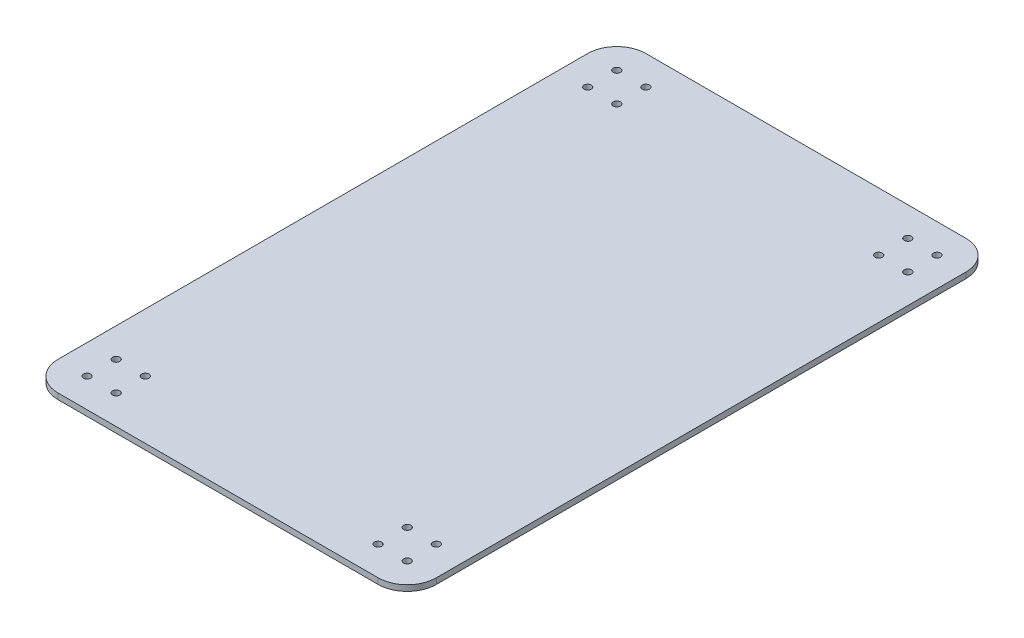
ISO-10303-21;
HEADER;
FILE_DESCRIPTION(('STEP AP214'),'2;1');
FILE_NAME('part.step','',(''),(''),'','','');
FILE_SCHEMA(('AUTOMOTIVE_DESIGN { 1 0 10303 214 1 1 1 1 }'));
ENDSEC;
DATA;
#1=APPLICATION_CONTEXT('core data for automotive mechanical design processes');
#2=APPLICATION_PROTOCOL_DEFINITION('international standard','automotive_design',2000,#1);
#3=PRODUCT_CONTEXT('',#1,'mechanical');
#4=PRODUCT('Part','Part','',(#3));
#5=PRODUCT_RELATED_PRODUCT_CATEGORY('part','',(#4));
#6=PRODUCT_DEFINITION_FORMATION('','',#4);
#7=PRODUCT_DEFINITION_CONTEXT('part definition',#1,'design');
#8=PRODUCT_DEFINITION('design','',#6,#7);
#9=PRODUCT_DEFINITION_SHAPE('','',#8);
#10=(LENGTH_UNIT() NAMED_UNIT(*) SI_UNIT(.MILLI.,.METRE.));
#11=(NAMED_UNIT(*) PLANE_ANGLE_UNIT() SI_UNIT($,.RADIAN.));
#12=(NAMED_UNIT(*) SI_UNIT($,.STERADIAN.) SOLID_ANGLE_UNIT());
#13=UNCERTAINTY_MEASURE_WITH_UNIT(LENGTH_MEASURE(1.E-05),#10,'distance_accuracy_value','');
#14=(GEOMETRIC_REPRESENTATION_CONTEXT(3) GLOBAL_UNCERTAINTY_ASSIGNED_CONTEXT((#13)) GLOBAL_UNIT_ASSIGNED_CONTEXT((#10,
#11,#12)) REPRESENTATION_CONTEXT('',''));
#15=CARTESIAN_POINT('',(0.,0.,0.));
#16=DIRECTION('',(0.,0.,1.));
#17=DIRECTION('',(1.,0.,0.));
#18=AXIS2_PLACEMENT_3D('',#15,#16,#17);
#19=CARTESIAN_POINT('',(-147.260105463568,5.08,256.34291835553));
#20=DIRECTION('',(0.,1.,0.));
#21=DIRECTION('',(0.,0.,1.));
#22=AXIS2_PLACEMENT_3D('',#19,#20,#21);
#23=PLANE('',#22);
#24=CARTESIAN_POINT('',(-121.860105463563,5.08,256.34291835553));
#25=DIRECTION('',(0.,1.,0.));
#26=DIRECTION('',(0.,0.,1.));
#27=AXIS2_PLACEMENT_3D('',#24,#25,#26);
#28=CIRCLE('',#27,3.175);
#29=CARTESIAN_POINT('',(-121.860105463563,5.08,259.51791835553));
#30=VERTEX_POINT('',#29);
#31=EDGE_CURVE('E266',#30,#30,#28,.T.);
#32=ORIENTED_EDGE('',*,*,#31,.F.);
#33=EDGE_LOOP('',(#32));
#34=FACE_BOUND('',#33,.T.);
#35=CARTESIAN_POINT('',(-147.260105463563,5.08,230.94291835553));
#36=DIRECTION('',(0.,1.,0.));
#37=DIRECTION('',(0.,0.,1.));
#38=AXIS2_PLACEMENT_3D('',#35,#36,#37);
#39=CIRCLE('',#38,3.175);
#40=CARTESIAN_POINT('',(-147.260105463563,5.08,234.11791835553));
#41=VERTEX_POINT('',#40);
#42=EDGE_CURVE('E254',#41,#41,#39,.T.);
#43=ORIENTED_EDGE('',*,*,#42,.F.);
#44=EDGE_LOOP('',(#43));
#45=FACE_BOUND('',#44,.T.);
#46=CARTESIAN_POINT('',(132.139894536437,5.08,256.34291835553));
#47=DIRECTION('',(0.,1.,0.));
#48=DIRECTION('',(0.,0.,1.));
#49=AXIS2_PLACEMENT_3D('',#46,#47,#48);
#50=CIRCLE('',#49,3.175);
#51=CARTESIAN_POINT('',(132.139894536437,5.08,259.51791835553));
#52=VERTEX_POINT('',#51);
#53=EDGE_CURVE('E242',#52,#52,#50,.T.);
#54=ORIENTED_EDGE('',*,*,#53,.F.);
#55=EDGE_LOOP('',(#54));
#56=FACE_BOUND('',#55,.T.);
#57=CARTESIAN_POINT('',(106.739894536437,5.08,230.94291835553));
#58=DIRECTION('',(0.,1.,0.));
#59=DIRECTION('',(0.,0.,1.));
#60=AXIS2_PLACEMENT_3D('',#57,#58,#59);
#61=CIRCLE('',#60,3.175);
#62=CARTESIAN_POINT('',(106.739894536437,5.08,234.11791835553));
#63=VERTEX_POINT('',#62);
#64=EDGE_CURVE('E230',#63,#63,#61,.T.);
#65=ORIENTED_EDGE('',*,*,#64,.F.);
#66=EDGE_LOOP('',(#65));
#67=FACE_BOUND('',#66,.T.);
#68=CARTESIAN_POINT('',(132.139894536433,5.08,-180.53708164447));
#69=DIRECTION('',(0.,1.,0.));
#70=DIRECTION('',(0.,0.,1.));
#71=AXIS2_PLACEMENT_3D('',#68,#69,#70);
#72=CIRCLE('',#71,3.175);
#73=CARTESIAN_POINT('',(132.139894536433,5.08,-177.36208164447));
#74=VERTEX_POINT('',#73);
#75=EDGE_CURVE('E218',#74,#74,#72,.T.);
#76=ORIENTED_EDGE('',*,*,#75,.F.);
#77=EDGE_LOOP('',(#76));
#78=FACE_BOUND('',#77,.T.);
#79=CARTESIAN_POINT('',(106.739894536432,5.08,-205.93708164447));
#80=DIRECTION('',(0.,1.,0.));
#81=DIRECTION('',(0.,0.,1.));
#82=AXIS2_PLACEMENT_3D('',#79,#80,#81);
#83=CIRCLE('',#82,3.175);
#84=CARTESIAN_POINT('',(106.739894536432,5.08,-202.76208164447));
#85=VERTEX_POINT('',#84);
#86=EDGE_CURVE('E206',#85,#85,#83,.T.);
#87=ORIENTED_EDGE('',*,*,#86,.F.);
#88=EDGE_LOOP('',(#87));
#89=FACE_BOUND('',#88,.T.);
#90=CARTESIAN_POINT('',(-121.860105463567,5.08,-180.53708164447));
#91=DIRECTION('',(0.,1.,0.));
#92=DIRECTION('',(0.,0.,1.));
#93=AXIS2_PLACEMENT_3D('',#90,#91,#92);
#94=CIRCLE('',#93,3.175);
#95=CARTESIAN_POINT('',(-121.860105463567,5.08,-177.36208164447));
#96=VERTEX_POINT('',#95);
#97=EDGE_CURVE('E194',#96,#96,#94,.T.);
#98=ORIENTED_EDGE('',*,*,#97,.F.);
#99=EDGE_LOOP('',(#98));
#100=FACE_BOUND('',#99,.T.);
#101=CARTESIAN_POINT('',(-147.260105463568,5.08,-205.93708164447));
#102=DIRECTION('',(0.,1.,0.));
#103=DIRECTION('',(0.,0.,1.));
#104=AXIS2_PLACEMENT_3D('',#101,#102,#103);
#105=CIRCLE('',#104,3.175);
#106=CARTESIAN_POINT('',(-147.260105463568,5.08,-202.76208164447));
#107=VERTEX_POINT('',#106);
#108=EDGE_CURVE('E140',#107,#107,#105,.T.);
#109=ORIENTED_EDGE('',*,*,#108,.F.);
#110=EDGE_LOOP('',(#109));
#111=FACE_BOUND('',#110,.T.);
#112=CARTESIAN_POINT('',(-147.260105463568,5.08,256.34291835553));
#113=DIRECTION('',(0.,1.,0.));
#114=DIRECTION('',(0.,0.,1.));
#115=AXIS2_PLACEMENT_3D('',#112,#113,#114);
#116=CIRCLE('',#115,25.4);
#117=CARTESIAN_POINT('',(-172.660105463568,5.08,256.34291835553));
#118=VERTEX_POINT('',#117);
#119=CARTESIAN_POINT('',(-147.260105463567,5.08,281.74291835553));
#120=VERTEX_POINT('',#119);
#121=EDGE_CURVE('E151',#118,#120,#116,.T.);
#122=ORIENTED_EDGE('',*,*,#121,.T.);
#123=DIRECTION('',(1.,0.,0.));
#124=VECTOR('',#123,1.);
#125=CARTESIAN_POINT('',(-147.260105463567,5.08,281.74291835553));
#126=LINE('',#125,#124);
#127=CARTESIAN_POINT('',(132.139894536432,5.08,281.74291835553));
#128=VERTEX_POINT('',#127);
#129=EDGE_CURVE('E99',#120,#128,#126,.T.);
#130=ORIENTED_EDGE('',*,*,#129,.T.);
#131=CARTESIAN_POINT('',(132.139894536432,5.08,256.34291835553));
#132=DIRECTION('',(0.,1.,0.));
#133=DIRECTION('',(0.,0.,1.));
#134=AXIS2_PLACEMENT_3D('',#131,#132,#133);
#135=CIRCLE('',#134,25.4);
#136=CARTESIAN_POINT('',(157.539894536432,5.08,256.34291835553));
#137=VERTEX_POINT('',#136);
#138=EDGE_CURVE('E166',#128,#137,#135,.T.);
#139=ORIENTED_EDGE('',*,*,#138,.T.);
#140=DIRECTION('',(0.,0.,-1.));
#141=VECTOR('',#140,1.);
#142=CARTESIAN_POINT('',(157.539894536432,5.08,-205.93708164447));
#143=LINE('',#142,#141);
#144=CARTESIAN_POINT('',(157.539894536432,5.08,-205.93708164447));
#145=VERTEX_POINT('',#144);
#146=EDGE_CURVE('E179',#137,#145,#143,.T.);
#147=ORIENTED_EDGE('',*,*,#146,.T.);
#148=CARTESIAN_POINT('',(132.139894536432,5.08,-205.93708164447));
#149=DIRECTION('',(0.,1.,0.));
#150=DIRECTION('',(0.,0.,-1.));
#151=AXIS2_PLACEMENT_3D('',#148,#149,#150);
#152=CIRCLE('',#151,25.4);
#153=CARTESIAN_POINT('',(132.139894536432,5.08,-231.33708164447));
#154=VERTEX_POINT('',#153);
#155=EDGE_CURVE('E118',#145,#154,#152,.T.);
#156=ORIENTED_EDGE('',*,*,#155,.T.);
#157=DIRECTION('',(-1.,0.,0.));
#158=VECTOR('',#157,1.);
#159=CARTESIAN_POINT('',(-147.260105463567,5.08,-231.33708164447));
#160=LINE('',#159,#158);
#161=CARTESIAN_POINT('',(-147.260105463567,5.08,-231.33708164447));
#162=VERTEX_POINT('',#161);
#163=EDGE_CURVE('E112',#154,#162,#160,.T.);
#164=ORIENTED_EDGE('',*,*,#163,.T.);
#165=CARTESIAN_POINT('',(-147.260105463568,5.08,-205.93708164447));
#166=DIRECTION('',(0.,1.,0.));
#167=DIRECTION('',(0.,0.,1.));
#168=AXIS2_PLACEMENT_3D('',#165,#166,#167);
#169=CIRCLE('',#168,25.4);
#170=CARTESIAN_POINT('',(-172.660105463568,5.08,-205.93708164447));
#171=VERTEX_POINT('',#170);
#172=EDGE_CURVE('E116',#162,#171,#169,.T.);
#173=ORIENTED_EDGE('',*,*,#172,.T.);
#174=DIRECTION('',(0.,0.,1.));
#175=VECTOR('',#174,1.);
#176=CARTESIAN_POINT('',(-172.660105463568,5.08,-205.93708164447));
#177=LINE('',#176,#175);
#178=EDGE_CURVE('E56',#171,#118,#177,.T.);
#179=ORIENTED_EDGE('',*,*,#178,.T.);
#180=EDGE_LOOP('',(#122,#130,#139,#147,#156,#164,#173,#179));
#181=FACE_BOUND('',#180,.T.);
#182=CARTESIAN_POINT('',(-121.860105463568,5.08,-205.93708164447));
#183=DIRECTION('',(0.,1.,0.));
#184=DIRECTION('',(0.,0.,1.));
#185=AXIS2_PLACEMENT_3D('',#182,#183,#184);
#186=CIRCLE('',#185,3.175);
#187=CARTESIAN_POINT('',(-121.860105463568,5.08,-202.76208164447));
#188=VERTEX_POINT('',#187);
#189=EDGE_CURVE('E188',#188,#188,#186,.T.);
#190=ORIENTED_EDGE('',*,*,#189,.F.);
#191=EDGE_LOOP('',(#190));
#192=FACE_BOUND('',#191,.T.);
#193=CARTESIAN_POINT('',(-147.260105463567,5.08,-180.53708164447));
#194=DIRECTION('',(0.,1.,0.));
#195=DIRECTION('',(0.,0.,1.));
#196=AXIS2_PLACEMENT_3D('',#193,#194,#195);
#197=CIRCLE('',#196,3.175);
#198=CARTESIAN_POINT('',(-147.260105463567,5.08,-177.36208164447));
#199=VERTEX_POINT('',#198);
#200=EDGE_CURVE('E200',#199,#199,#197,.T.);
#201=ORIENTED_EDGE('',*,*,#200,.F.);
#202=EDGE_LOOP('',(#201));
#203=FACE_BOUND('',#202,.T.);
#204=CARTESIAN_POINT('',(132.139894536432,5.08,-205.93708164447));
#205=DIRECTION('',(0.,1.,0.));
#206=DIRECTION('',(0.,0.,1.));
#207=AXIS2_PLACEMENT_3D('',#204,#205,#206);
#208=CIRCLE('',#207,3.175);
#209=CARTESIAN_POINT('',(132.139894536432,5.08,-202.76208164447));
#210=VERTEX_POINT('',#209);
#211=EDGE_CURVE('E212',#210,#210,#208,.T.);
#212=ORIENTED_EDGE('',*,*,#211,.F.);
#213=EDGE_LOOP('',(#212));
#214=FACE_BOUND('',#213,.T.);
#215=CARTESIAN_POINT('',(106.739894536433,5.08,-180.53708164447));
#216=DIRECTION('',(0.,1.,0.));
#217=DIRECTION('',(0.,0.,1.));
#218=AXIS2_PLACEMENT_3D('',#215,#216,#217);
#219=CIRCLE('',#218,3.175);
#220=CARTESIAN_POINT('',(106.739894536433,5.08,-177.36208164447));
#221=VERTEX_POINT('',#220);
#222=EDGE_CURVE('E224',#221,#221,#219,.T.);
#223=ORIENTED_EDGE('',*,*,#222,.F.);
#224=EDGE_LOOP('',(#223));
#225=FACE_BOUND('',#224,.T.);
#226=CARTESIAN_POINT('',(132.139894536437,5.08,230.94291835553));
#227=DIRECTION('',(0.,1.,0.));
#228=DIRECTION('',(0.,0.,1.));
#229=AXIS2_PLACEMENT_3D('',#226,#227,#228);
#230=CIRCLE('',#229,3.175);
#231=CARTESIAN_POINT('',(132.139894536437,5.08,234.11791835553));
#232=VERTEX_POINT('',#231);
#233=EDGE_CURVE('E236',#232,#232,#230,.T.);
#234=ORIENTED_EDGE('',*,*,#233,.F.);
#235=EDGE_LOOP('',(#234));
#236=FACE_BOUND('',#235,.T.);
#237=CARTESIAN_POINT('',(106.739894536437,5.08,256.34291835553));
#238=DIRECTION('',(0.,1.,0.));
#239=DIRECTION('',(0.,0.,1.));
#240=AXIS2_PLACEMENT_3D('',#237,#238,#239);
#241=CIRCLE('',#240,3.175);
#242=CARTESIAN_POINT('',(106.739894536437,5.08,259.51791835553));
#243=VERTEX_POINT('',#242);
#244=EDGE_CURVE('E248',#243,#243,#241,.T.);
#245=ORIENTED_EDGE('',*,*,#244,.F.);
#246=EDGE_LOOP('',(#245));
#247=FACE_BOUND('',#246,.T.);
#248=CARTESIAN_POINT('',(-121.860105463563,5.08,230.94291835553));
#249=DIRECTION('',(0.,1.,0.));
#250=DIRECTION('',(0.,0.,1.));
#251=AXIS2_PLACEMENT_3D('',#248,#249,#250);
#252=CIRCLE('',#251,3.175);
#253=CARTESIAN_POINT('',(-121.860105463563,5.08,234.11791835553));
#254=VERTEX_POINT('',#253);
#255=EDGE_CURVE('E260',#254,#254,#252,.T.);
#256=ORIENTED_EDGE('',*,*,#255,.F.);
#257=EDGE_LOOP('',(#256));
#258=FACE_BOUND('',#257,.T.);
#259=CARTESIAN_POINT('',(-147.260105463563,5.08,256.34291835553));
#260=DIRECTION('',(0.,1.,0.));
#261=DIRECTION('',(0.,0.,1.));
#262=AXIS2_PLACEMENT_3D('',#259,#260,#261);
#263=CIRCLE('',#262,3.175);
#264=CARTESIAN_POINT('',(-147.260105463563,5.08,259.51791835553));
#265=VERTEX_POINT('',#264);
#266=EDGE_CURVE('E272',#265,#265,#263,.T.);
#267=ORIENTED_EDGE('',*,*,#266,.F.);
#268=EDGE_LOOP('',(#267));
#269=FACE_BOUND('',#268,.T.);
#270=ADVANCED_FACE('F39',(#34,#45,#56,#67,#78,#89,#100,#111,#181,#192,#203,#214,#225,#236,#247,
#258,#269),#23,.T.);
#271=CARTESIAN_POINT('',(-147.260105463568,0.,256.34291835553));
#272=DIRECTION('',(0.,1.,0.));
#273=DIRECTION('',(0.,0.,1.));
#274=AXIS2_PLACEMENT_3D('',#271,#272,#273);
#275=PLANE('',#274);
#276=CARTESIAN_POINT('',(-147.260105463568,0.,256.34291835553));
#277=DIRECTION('',(0.,1.,0.));
#278=DIRECTION('',(0.,0.,1.));
#279=AXIS2_PLACEMENT_3D('',#276,#277,#278);
#280=CIRCLE('',#279,25.4);
#281=CARTESIAN_POINT('',(-172.660105463568,0.,256.34291835553));
#282=VERTEX_POINT('',#281);
#283=CARTESIAN_POINT('',(-147.260105463567,0.,281.74291835553));
#284=VERTEX_POINT('',#283);
#285=EDGE_CURVE('E136',#282,#284,#280,.T.);
#286=ORIENTED_EDGE('',*,*,#285,.F.);
#287=DIRECTION('',(0.,0.,1.));
#288=VECTOR('',#287,1.);
#289=CARTESIAN_POINT('',(-172.660105463568,0.,-205.93708164447));
#290=LINE('',#289,#288);
#291=CARTESIAN_POINT('',(-172.660105463568,0.,-205.93708164447));
#292=VERTEX_POINT('',#291);
#293=EDGE_CURVE('E91',#292,#282,#290,.T.);
#294=ORIENTED_EDGE('',*,*,#293,.F.);
#295=CARTESIAN_POINT('',(-147.260105463568,0.,-205.93708164447));
#296=DIRECTION('',(0.,1.,0.));
#297=DIRECTION('',(0.,0.,1.));
#298=AXIS2_PLACEMENT_3D('',#295,#296,#297);
#299=CIRCLE('',#298,25.4);
#300=CARTESIAN_POINT('',(-147.260105463567,0.,-231.33708164447));
#301=VERTEX_POINT('',#300);
#302=EDGE_CURVE('E85',#301,#292,#299,.T.);
#303=ORIENTED_EDGE('',*,*,#302,.F.);
#304=DIRECTION('',(-1.,0.,0.));
#305=VECTOR('',#304,1.);
#306=CARTESIAN_POINT('',(-147.260105463567,0.,-231.33708164447));
#307=LINE('',#306,#305);
#308=CARTESIAN_POINT('',(132.139894536432,0.,-231.33708164447));
#309=VERTEX_POINT('',#308);
#310=EDGE_CURVE('E126',#309,#301,#307,.T.);
#311=ORIENTED_EDGE('',*,*,#310,.F.);
#312=CARTESIAN_POINT('',(132.139894536432,0.,-205.93708164447));
#313=DIRECTION('',(0.,1.,0.));
#314=DIRECTION('',(0.,0.,-1.));
#315=AXIS2_PLACEMENT_3D('',#312,#313,#314);
#316=CIRCLE('',#315,25.4);
#317=CARTESIAN_POINT('',(157.539894536432,0.,-205.93708164447));
#318=VERTEX_POINT('',#317);
#319=EDGE_CURVE('E146',#318,#309,#316,.T.);
#320=ORIENTED_EDGE('',*,*,#319,.F.);
#321=DIRECTION('',(0.,0.,-1.));
#322=VECTOR('',#321,1.);
#323=CARTESIAN_POINT('',(157.539894536432,0.,-205.93708164447));
#324=LINE('',#323,#322);
#325=CARTESIAN_POINT('',(157.539894536432,0.,256.34291835553));
#326=VERTEX_POINT('',#325);
#327=EDGE_CURVE('E144',#326,#318,#324,.T.);
#328=ORIENTED_EDGE('',*,*,#327,.F.);
#329=CARTESIAN_POINT('',(132.139894536432,0.,256.34291835553));
#330=DIRECTION('',(0.,1.,0.));
#331=DIRECTION('',(0.,0.,1.));
#332=AXIS2_PLACEMENT_3D('',#329,#330,#331);
#333=CIRCLE('',#332,25.4);
#334=CARTESIAN_POINT('',(132.139894536432,0.,281.74291835553));
#335=VERTEX_POINT('',#334);
#336=EDGE_CURVE('E142',#335,#326,#333,.T.);
#337=ORIENTED_EDGE('',*,*,#336,.F.);
#338=DIRECTION('',(1.,0.,0.));
#339=VECTOR('',#338,1.);
#340=CARTESIAN_POINT('',(-147.260105463567,0.,281.74291835553));
#341=LINE('',#340,#339);
#342=EDGE_CURVE('E139',#284,#335,#341,.T.);
#343=ORIENTED_EDGE('',*,*,#342,.F.);
#344=EDGE_LOOP('',(#286,#294,#303,#311,#320,#328,#337,#343));
#345=FACE_BOUND('',#344,.T.);
#346=CARTESIAN_POINT('',(-147.260105463568,0.,-205.93708164447));
#347=DIRECTION('',(0.,1.,0.));
#348=DIRECTION('',(0.,0.,1.));
#349=AXIS2_PLACEMENT_3D('',#346,#347,#348);
#350=CIRCLE('',#349,3.175);
#351=CARTESIAN_POINT('',(-147.260105463568,0.,-202.76208164447));
#352=VERTEX_POINT('',#351);
#353=EDGE_CURVE('E185',#352,#352,#350,.T.);
#354=ORIENTED_EDGE('',*,*,#353,.T.);
#355=EDGE_LOOP('',(#354));
#356=FACE_BOUND('',#355,.T.);
#357=CARTESIAN_POINT('',(-121.860105463568,0.,-205.93708164447));
#358=DIRECTION('',(0.,1.,0.));
#359=DIRECTION('',(0.,0.,1.));
#360=AXIS2_PLACEMENT_3D('',#357,#358,#359);
#361=CIRCLE('',#360,3.175);
#362=CARTESIAN_POINT('',(-121.860105463568,0.,-202.76208164447));
#363=VERTEX_POINT('',#362);
#364=EDGE_CURVE('E191',#363,#363,#361,.T.);
#365=ORIENTED_EDGE('',*,*,#364,.T.);
#366=EDGE_LOOP('',(#365));
#367=FACE_BOUND('',#366,.T.);
#368=CARTESIAN_POINT('',(-121.860105463567,0.,-180.53708164447));
#369=DIRECTION('',(0.,1.,0.));
#370=DIRECTION('',(0.,0.,1.));
#371=AXIS2_PLACEMENT_3D('',#368,#369,#370);
#372=CIRCLE('',#371,3.175);
#373=CARTESIAN_POINT('',(-121.860105463567,0.,-177.36208164447));
#374=VERTEX_POINT('',#373);
#375=EDGE_CURVE('E197',#374,#374,#372,.T.);
#376=ORIENTED_EDGE('',*,*,#375,.T.);
#377=EDGE_LOOP('',(#376));
#378=FACE_BOUND('',#377,.T.);
#379=CARTESIAN_POINT('',(-147.260105463567,0.,-180.53708164447));
#380=DIRECTION('',(0.,1.,0.));
#381=DIRECTION('',(0.,0.,1.));
#382=AXIS2_PLACEMENT_3D('',#379,#380,#381);
#383=CIRCLE('',#382,3.175);
#384=CARTESIAN_POINT('',(-147.260105463567,0.,-177.36208164447));
#385=VERTEX_POINT('',#384);
#386=EDGE_CURVE('E203',#385,#385,#383,.T.);
#387=ORIENTED_EDGE('',*,*,#386,.T.);
#388=EDGE_LOOP('',(#387));
#389=FACE_BOUND('',#388,.T.);
#390=CARTESIAN_POINT('',(106.739894536432,0.,-205.93708164447));
#391=DIRECTION('',(0.,1.,0.));
#392=DIRECTION('',(0.,0.,1.));
#393=AXIS2_PLACEMENT_3D('',#390,#391,#392);
#394=CIRCLE('',#393,3.175);
#395=CARTESIAN_POINT('',(106.739894536432,0.,-202.76208164447));
#396=VERTEX_POINT('',#395);
#397=EDGE_CURVE('E209',#396,#396,#394,.T.);
#398=ORIENTED_EDGE('',*,*,#397,.T.);
#399=EDGE_LOOP('',(#398));
#400=FACE_BOUND('',#399,.T.);
#401=CARTESIAN_POINT('',(132.139894536432,0.,-205.93708164447));
#402=DIRECTION('',(0.,1.,0.));
#403=DIRECTION('',(0.,0.,1.));
#404=AXIS2_PLACEMENT_3D('',#401,#402,#403);
#405=CIRCLE('',#404,3.175);
#406=CARTESIAN_POINT('',(132.139894536432,0.,-202.76208164447));
#407=VERTEX_POINT('',#406);
#408=EDGE_CURVE('E215',#407,#407,#405,.T.);
#409=ORIENTED_EDGE('',*,*,#408,.T.);
#410=EDGE_LOOP('',(#409));
#411=FACE_BOUND('',#410,.T.);
#412=CARTESIAN_POINT('',(132.139894536433,0.,-180.53708164447));
#413=DIRECTION('',(0.,1.,0.));
#414=DIRECTION('',(0.,0.,1.));
#415=AXIS2_PLACEMENT_3D('',#412,#413,#414);
#416=CIRCLE('',#415,3.175);
#417=CARTESIAN_POINT('',(132.139894536433,0.,-177.36208164447));
#418=VERTEX_POINT('',#417);
#419=EDGE_CURVE('E221',#418,#418,#416,.T.);
#420=ORIENTED_EDGE('',*,*,#419,.T.);
#421=EDGE_LOOP('',(#420));
#422=FACE_BOUND('',#421,.T.);
#423=CARTESIAN_POINT('',(106.739894536433,0.,-180.53708164447));
#424=DIRECTION('',(0.,1.,0.));
#425=DIRECTION('',(0.,0.,1.));
#426=AXIS2_PLACEMENT_3D('',#423,#424,#425);
#427=CIRCLE('',#426,3.175);
#428=CARTESIAN_POINT('',(106.739894536433,0.,-177.36208164447));
#429=VERTEX_POINT('',#428);
#430=EDGE_CURVE('E227',#429,#429,#427,.T.);
#431=ORIENTED_EDGE('',*,*,#430,.T.);
#432=EDGE_LOOP('',(#431));
#433=FACE_BOUND('',#432,.T.);
#434=CARTESIAN_POINT('',(106.739894536437,0.,230.94291835553));
#435=DIRECTION('',(0.,1.,0.));
#436=DIRECTION('',(0.,0.,1.));
#437=AXIS2_PLACEMENT_3D('',#434,#435,#436);
#438=CIRCLE('',#437,3.175);
#439=CARTESIAN_POINT('',(106.739894536437,0.,234.11791835553));
#440=VERTEX_POINT('',#439);
#441=EDGE_CURVE('E233',#440,#440,#438,.T.);
#442=ORIENTED_EDGE('',*,*,#441,.T.);
#443=EDGE_LOOP('',(#442));
#444=FACE_BOUND('',#443,.T.);
#445=CARTESIAN_POINT('',(132.139894536437,0.,230.94291835553));
#446=DIRECTION('',(0.,1.,0.));
#447=DIRECTION('',(0.,0.,1.));
#448=AXIS2_PLACEMENT_3D('',#445,#446,#447);
#449=CIRCLE('',#448,3.175);
#450=CARTESIAN_POINT('',(132.139894536437,0.,234.11791835553));
#451=VERTEX_POINT('',#450);
#452=EDGE_CURVE('E239',#451,#451,#449,.T.);
#453=ORIENTED_EDGE('',*,*,#452,.T.);
#454=EDGE_LOOP('',(#453));
#455=FACE_BOUND('',#454,.T.);
#456=CARTESIAN_POINT('',(132.139894536437,0.,256.34291835553));
#457=DIRECTION('',(0.,1.,0.));
#458=DIRECTION('',(0.,0.,1.));
#459=AXIS2_PLACEMENT_3D('',#456,#457,#458);
#460=CIRCLE('',#459,3.175);
#461=CARTESIAN_POINT('',(132.139894536437,0.,259.51791835553));
#462=VERTEX_POINT('',#461);
#463=EDGE_CURVE('E245',#462,#462,#460,.T.);
#464=ORIENTED_EDGE('',*,*,#463,.T.);
#465=EDGE_LOOP('',(#464));
#466=FACE_BOUND('',#465,.T.);
#467=CARTESIAN_POINT('',(106.739894536437,0.,256.34291835553));
#468=DIRECTION('',(0.,1.,0.));
#469=DIRECTION('',(0.,0.,1.));
#470=AXIS2_PLACEMENT_3D('',#467,#468,#469);
#471=CIRCLE('',#470,3.175);
#472=CARTESIAN_POINT('',(106.739894536437,0.,259.51791835553));
#473=VERTEX_POINT('',#472);
#474=EDGE_CURVE('E251',#473,#473,#471,.T.);
#475=ORIENTED_EDGE('',*,*,#474,.T.);
#476=EDGE_LOOP('',(#475));
#477=FACE_BOUND('',#476,.T.);
#478=CARTESIAN_POINT('',(-147.260105463563,0.,230.94291835553));
#479=DIRECTION('',(0.,1.,0.));
#480=DIRECTION('',(0.,0.,1.));
#481=AXIS2_PLACEMENT_3D('',#478,#479,#480);
#482=CIRCLE('',#481,3.175);
#483=CARTESIAN_POINT('',(-147.260105463563,0.,234.11791835553));
#484=VERTEX_POINT('',#483);
#485=EDGE_CURVE('E257',#484,#484,#482,.T.);
#486=ORIENTED_EDGE('',*,*,#485,.T.);
#487=EDGE_LOOP('',(#486));
#488=FACE_BOUND('',#487,.T.);
#489=CARTESIAN_POINT('',(-121.860105463563,0.,230.94291835553));
#490=DIRECTION('',(0.,1.,0.));
#491=DIRECTION('',(0.,0.,1.));
#492=AXIS2_PLACEMENT_3D('',#489,#490,#491);
#493=CIRCLE('',#492,3.175);
#494=CARTESIAN_POINT('',(-121.860105463563,0.,234.11791835553));
#495=VERTEX_POINT('',#494);
#496=EDGE_CURVE('E263',#495,#495,#493,.T.);
#497=ORIENTED_EDGE('',*,*,#496,.T.);
#498=EDGE_LOOP('',(#497));
#499=FACE_BOUND('',#498,.T.);
#500=CARTESIAN_POINT('',(-121.860105463563,0.,256.34291835553));
#501=DIRECTION('',(0.,1.,0.));
#502=DIRECTION('',(0.,0.,1.));
#503=AXIS2_PLACEMENT_3D('',#500,#501,#502);
#504=CIRCLE('',#503,3.175);
#505=CARTESIAN_POINT('',(-121.860105463563,0.,259.51791835553));
#506=VERTEX_POINT('',#505);
#507=EDGE_CURVE('E269',#506,#506,#504,.T.);
#508=ORIENTED_EDGE('',*,*,#507,.T.);
#509=EDGE_LOOP('',(#508));
#510=FACE_BOUND('',#509,.T.);
#511=CARTESIAN_POINT('',(-147.260105463563,0.,256.34291835553));
#512=DIRECTION('',(0.,1.,0.));
#513=DIRECTION('',(0.,0.,1.));
#514=AXIS2_PLACEMENT_3D('',#511,#512,#513);
#515=CIRCLE('',#514,3.175);
#516=CARTESIAN_POINT('',(-147.260105463563,0.,259.51791835553));
#517=VERTEX_POINT('',#516);
#518=EDGE_CURVE('E275',#517,#517,#515,.T.);
#519=ORIENTED_EDGE('',*,*,#518,.T.);
#520=EDGE_LOOP('',(#519));
#521=FACE_BOUND('',#520,.T.);
#522=ADVANCED_FACE('F170',(#345,#356,#367,#378,#389,#400,#411,#422,#433,#444,#455,#466,#477,
#488,#499,#510,#521),#275,.F.);
#523=CARTESIAN_POINT('',(-147.260105463568,5.08,256.34291835553));
#524=DIRECTION('',(0.,-1.,0.));
#525=DIRECTION('',(0.,0.,-1.));
#526=AXIS2_PLACEMENT_3D('',#523,#524,#525);
#527=CYLINDRICAL_SURFACE('',#526,25.4);
#528=ORIENTED_EDGE('',*,*,#285,.T.);
#529=DIRECTION('',(0.,-1.,0.));
#530=VECTOR('',#529,1.);
#531=CARTESIAN_POINT('',(-147.260105463567,5.08,281.74291835553));
#532=LINE('',#531,#530);
#533=EDGE_CURVE('E11',#120,#284,#532,.T.);
#534=ORIENTED_EDGE('',*,*,#533,.F.);
#535=ORIENTED_EDGE('',*,*,#121,.F.);
#536=DIRECTION('',(0.,-1.,0.));
#537=VECTOR('',#536,1.);
#538=CARTESIAN_POINT('',(-172.660105463568,5.08,256.34291835553));
#539=LINE('',#538,#537);
#540=EDGE_CURVE('E132',#118,#282,#539,.T.);
#541=ORIENTED_EDGE('',*,*,#540,.T.);
#542=EDGE_LOOP('',(#528,#534,#535,#541));
#543=FACE_BOUND('',#542,.T.);
#544=ADVANCED_FACE('F41',(#543),#527,.T.);
#545=CARTESIAN_POINT('',(-147.260105463567,5.08,281.74291835553));
#546=DIRECTION('',(0.,0.,-1.));
#547=DIRECTION('',(-1.,0.,0.));
#548=AXIS2_PLACEMENT_3D('',#545,#546,#547);
#549=PLANE('',#548);
#550=ORIENTED_EDGE('',*,*,#342,.T.);
#551=DIRECTION('',(0.,-1.,0.));
#552=VECTOR('',#551,1.);
#553=CARTESIAN_POINT('',(132.139894536432,5.08,281.74291835553));
#554=LINE('',#553,#552);
#555=EDGE_CURVE('E48',#128,#335,#554,.T.);
#556=ORIENTED_EDGE('',*,*,#555,.F.);
#557=ORIENTED_EDGE('',*,*,#129,.F.);
#558=ORIENTED_EDGE('',*,*,#533,.T.);
#559=EDGE_LOOP('',(#550,#556,#557,#558));
#560=FACE_BOUND('',#559,.T.);
#561=ADVANCED_FACE('F309',(#560),#549,.F.);
#562=CARTESIAN_POINT('',(132.139894536432,5.08,256.34291835553));
#563=DIRECTION('',(0.,-1.,0.));
#564=DIRECTION('',(0.,0.,-1.));
#565=AXIS2_PLACEMENT_3D('',#562,#563,#564);
#566=CYLINDRICAL_SURFACE('',#565,25.4);
#567=ORIENTED_EDGE('',*,*,#336,.T.);
#568=DIRECTION('',(0.,-1.,0.));
#569=VECTOR('',#568,1.);
#570=CARTESIAN_POINT('',(157.539894536432,5.08,256.34291835553));
#571=LINE('',#570,#569);
#572=EDGE_CURVE('E158',#137,#326,#571,.T.);
#573=ORIENTED_EDGE('',*,*,#572,.F.);
#574=ORIENTED_EDGE('',*,*,#138,.F.);
#575=ORIENTED_EDGE('',*,*,#555,.T.);
#576=EDGE_LOOP('',(#567,#573,#574,#575));
#577=FACE_BOUND('',#576,.T.);
#578=ADVANCED_FACE('F164',(#577),#566,.T.);
#579=CARTESIAN_POINT('',(157.539894536432,5.08,-205.93708164447));
#580=DIRECTION('',(-1.,0.,0.));
#581=DIRECTION('',(0.,0.,1.));
#582=AXIS2_PLACEMENT_3D('',#579,#580,#581);
#583=PLANE('',#582);
#584=ORIENTED_EDGE('',*,*,#327,.T.);
#585=DIRECTION('',(0.,-1.,0.));
#586=VECTOR('',#585,1.);
#587=CARTESIAN_POINT('',(157.539894536432,5.08,-205.93708164447));
#588=LINE('',#587,#586);
#589=EDGE_CURVE('E155',#145,#318,#588,.T.);
#590=ORIENTED_EDGE('',*,*,#589,.F.);
#591=ORIENTED_EDGE('',*,*,#146,.F.);
#592=ORIENTED_EDGE('',*,*,#572,.T.);
#593=EDGE_LOOP('',(#584,#590,#591,#592));
#594=FACE_BOUND('',#593,.T.);
#595=ADVANCED_FACE('F175',(#594),#583,.F.);
#596=CARTESIAN_POINT('',(132.139894536432,5.08,-205.93708164447));
#597=DIRECTION('',(0.,-1.,0.));
#598=DIRECTION('',(0.,0.,-1.));
#599=AXIS2_PLACEMENT_3D('',#596,#597,#598);
#600=CYLINDRICAL_SURFACE('',#599,25.4);
#601=ORIENTED_EDGE('',*,*,#319,.T.);
#602=DIRECTION('',(0.,-1.,0.));
#603=VECTOR('',#602,1.);
#604=CARTESIAN_POINT('',(132.139894536432,5.08,-231.33708164447));
#605=LINE('',#604,#603);
#606=EDGE_CURVE('E127',#154,#309,#605,.T.);
#607=ORIENTED_EDGE('',*,*,#606,.F.);
#608=ORIENTED_EDGE('',*,*,#155,.F.);
#609=ORIENTED_EDGE('',*,*,#589,.T.);
#610=EDGE_LOOP('',(#601,#607,#608,#609));
#611=FACE_BOUND('',#610,.T.);
#612=ADVANCED_FACE('F178',(#611),#600,.T.);
#613=CARTESIAN_POINT('',(-147.260105463567,5.08,-231.33708164447));
#614=DIRECTION('',(0.,0.,1.));
#615=DIRECTION('',(1.,0.,0.));
#616=AXIS2_PLACEMENT_3D('',#613,#614,#615);
#617=PLANE('',#616);
#618=ORIENTED_EDGE('',*,*,#310,.T.);
#619=DIRECTION('',(0.,-1.,0.));
#620=VECTOR('',#619,1.);
#621=CARTESIAN_POINT('',(-147.260105463567,5.08,-231.33708164447));
#622=LINE('',#621,#620);
#623=EDGE_CURVE('E123',#162,#301,#622,.T.);
#624=ORIENTED_EDGE('',*,*,#623,.F.);
#625=ORIENTED_EDGE('',*,*,#163,.F.);
#626=ORIENTED_EDGE('',*,*,#606,.T.);
#627=EDGE_LOOP('',(#618,#624,#625,#626));
#628=FACE_BOUND('',#627,.T.);
#629=ADVANCED_FACE('F124',(#628),#617,.F.);
#630=CARTESIAN_POINT('',(-147.260105463568,5.08,-205.93708164447));
#631=DIRECTION('',(0.,-1.,0.));
#632=DIRECTION('',(0.,0.,-1.));
#633=AXIS2_PLACEMENT_3D('',#630,#631,#632);
#634=CYLINDRICAL_SURFACE('',#633,25.4);
#635=ORIENTED_EDGE('',*,*,#302,.T.);
#636=DIRECTION('',(0.,-1.,0.));
#637=VECTOR('',#636,1.);
#638=CARTESIAN_POINT('',(-172.660105463568,5.08,-205.93708164447));
#639=LINE('',#638,#637);
#640=EDGE_CURVE('E128',#171,#292,#639,.T.);
#641=ORIENTED_EDGE('',*,*,#640,.F.);
#642=ORIENTED_EDGE('',*,*,#172,.F.);
#643=ORIENTED_EDGE('',*,*,#623,.T.);
#644=EDGE_LOOP('',(#635,#641,#642,#643));
#645=FACE_BOUND('',#644,.T.);
#646=ADVANCED_FACE('F130',(#645),#634,.T.);
#647=CARTESIAN_POINT('',(-172.660105463568,5.08,-205.93708164447));
#648=DIRECTION('',(1.,0.,0.));
#649=DIRECTION('',(0.,0.,-1.));
#650=AXIS2_PLACEMENT_3D('',#647,#648,#649);
#651=PLANE('',#650);
#652=ORIENTED_EDGE('',*,*,#293,.T.);
#653=ORIENTED_EDGE('',*,*,#540,.F.);
#654=ORIENTED_EDGE('',*,*,#178,.F.);
#655=ORIENTED_EDGE('',*,*,#640,.T.);
#656=EDGE_LOOP('',(#652,#653,#654,#655));
#657=FACE_BOUND('',#656,.T.);
#658=ADVANCED_FACE('F297',(#657),#651,.F.);
#659=CARTESIAN_POINT('',(-147.260105463568,5.08,-205.93708164447));
#660=DIRECTION('',(0.,-1.,0.));
#661=DIRECTION('',(0.,0.,-1.));
#662=AXIS2_PLACEMENT_3D('',#659,#660,#661);
#663=CYLINDRICAL_SURFACE('',#662,3.175);
#664=ORIENTED_EDGE('',*,*,#108,.T.);
#665=EDGE_LOOP('',(#664));
#666=FACE_BOUND('',#665,.T.);
#667=ORIENTED_EDGE('',*,*,#353,.F.);
#668=EDGE_LOOP('',(#667));
#669=FACE_BOUND('',#668,.T.);
#670=ADVANCED_FACE('F294',(#666,#669),#663,.F.);
#671=CARTESIAN_POINT('',(-121.860105463568,5.08,-205.93708164447));
#672=DIRECTION('',(0.,-1.,0.));
#673=DIRECTION('',(0.,0.,-1.));
#674=AXIS2_PLACEMENT_3D('',#671,#672,#673);
#675=CYLINDRICAL_SURFACE('',#674,3.175);
#676=ORIENTED_EDGE('',*,*,#189,.T.);
#677=EDGE_LOOP('',(#676));
#678=FACE_BOUND('',#677,.T.);
#679=ORIENTED_EDGE('',*,*,#364,.F.);
#680=EDGE_LOOP('',(#679));
#681=FACE_BOUND('',#680,.T.);
#682=ADVANCED_FACE('F372',(#678,#681),#675,.F.);
#683=CARTESIAN_POINT('',(-121.860105463567,5.08,-180.53708164447));
#684=DIRECTION('',(0.,-1.,0.));
#685=DIRECTION('',(0.,0.,-1.));
#686=AXIS2_PLACEMENT_3D('',#683,#684,#685);
#687=CYLINDRICAL_SURFACE('',#686,3.175);
#688=ORIENTED_EDGE('',*,*,#97,.T.);
#689=EDGE_LOOP('',(#688));
#690=FACE_BOUND('',#689,.T.);
#691=ORIENTED_EDGE('',*,*,#375,.F.);
#692=EDGE_LOOP('',(#691));
#693=FACE_BOUND('',#692,.T.);
#694=ADVANCED_FACE('F380',(#690,#693),#687,.F.);
#695=CARTESIAN_POINT('',(-147.260105463567,5.08,-180.53708164447));
#696=DIRECTION('',(0.,-1.,0.));
#697=DIRECTION('',(0.,0.,-1.));
#698=AXIS2_PLACEMENT_3D('',#695,#696,#697);
#699=CYLINDRICAL_SURFACE('',#698,3.175);
#700=ORIENTED_EDGE('',*,*,#200,.T.);
#701=EDGE_LOOP('',(#700));
#702=FACE_BOUND('',#701,.T.);
#703=ORIENTED_EDGE('',*,*,#386,.F.);
#704=EDGE_LOOP('',(#703));
#705=FACE_BOUND('',#704,.T.);
#706=ADVANCED_FACE('F388',(#702,#705),#699,.F.);
#707=CARTESIAN_POINT('',(106.739894536432,5.08,-205.93708164447));
#708=DIRECTION('',(0.,-1.,0.));
#709=DIRECTION('',(0.,0.,-1.));
#710=AXIS2_PLACEMENT_3D('',#707,#708,#709);
#711=CYLINDRICAL_SURFACE('',#710,3.175);
#712=ORIENTED_EDGE('',*,*,#86,.T.);
#713=EDGE_LOOP('',(#712));
#714=FACE_BOUND('',#713,.T.);
#715=ORIENTED_EDGE('',*,*,#397,.F.);
#716=EDGE_LOOP('',(#715));
#717=FACE_BOUND('',#716,.T.);
#718=ADVANCED_FACE('F397',(#714,#717),#711,.F.);
#719=CARTESIAN_POINT('',(132.139894536432,5.08,-205.93708164447));
#720=DIRECTION('',(0.,-1.,0.));
#721=DIRECTION('',(0.,0.,-1.));
#722=AXIS2_PLACEMENT_3D('',#719,#720,#721);
#723=CYLINDRICAL_SURFACE('',#722,3.175);
#724=ORIENTED_EDGE('',*,*,#211,.T.);
#725=EDGE_LOOP('',(#724));
#726=FACE_BOUND('',#725,.T.);
#727=ORIENTED_EDGE('',*,*,#408,.F.);
#728=EDGE_LOOP('',(#727));
#729=FACE_BOUND('',#728,.T.);
#730=ADVANCED_FACE('F406',(#726,#729),#723,.F.);
#731=CARTESIAN_POINT('',(132.139894536433,5.08,-180.53708164447));
#732=DIRECTION('',(0.,-1.,0.));
#733=DIRECTION('',(0.,0.,-1.));
#734=AXIS2_PLACEMENT_3D('',#731,#732,#733);
#735=CYLINDRICAL_SURFACE('',#734,3.175);
#736=ORIENTED_EDGE('',*,*,#75,.T.);
#737=EDGE_LOOP('',(#736));
#738=FACE_BOUND('',#737,.T.);
#739=ORIENTED_EDGE('',*,*,#419,.F.);
#740=EDGE_LOOP('',(#739));
#741=FACE_BOUND('',#740,.T.);
#742=ADVANCED_FACE('F415',(#738,#741),#735,.F.);
#743=CARTESIAN_POINT('',(106.739894536433,5.08,-180.53708164447));
#744=DIRECTION('',(0.,-1.,0.));
#745=DIRECTION('',(0.,0.,-1.));
#746=AXIS2_PLACEMENT_3D('',#743,#744,#745);
#747=CYLINDRICAL_SURFACE('',#746,3.175);
#748=ORIENTED_EDGE('',*,*,#222,.T.);
#749=EDGE_LOOP('',(#748));
#750=FACE_BOUND('',#749,.T.);
#751=ORIENTED_EDGE('',*,*,#430,.F.);
#752=EDGE_LOOP('',(#751));
#753=FACE_BOUND('',#752,.T.);
#754=ADVANCED_FACE('F424',(#750,#753),#747,.F.);
#755=CARTESIAN_POINT('',(106.739894536437,5.08,230.94291835553));
#756=DIRECTION('',(0.,-1.,0.));
#757=DIRECTION('',(0.,0.,-1.));
#758=AXIS2_PLACEMENT_3D('',#755,#756,#757);
#759=CYLINDRICAL_SURFACE('',#758,3.175);
#760=ORIENTED_EDGE('',*,*,#64,.T.);
#761=EDGE_LOOP('',(#760));
#762=FACE_BOUND('',#761,.T.);
#763=ORIENTED_EDGE('',*,*,#441,.F.);
#764=EDGE_LOOP('',(#763));
#765=FACE_BOUND('',#764,.T.);
#766=ADVANCED_FACE('F433',(#762,#765),#759,.F.);
#767=CARTESIAN_POINT('',(132.139894536437,5.08,230.94291835553));
#768=DIRECTION('',(0.,-1.,0.));
#769=DIRECTION('',(0.,0.,-1.));
#770=AXIS2_PLACEMENT_3D('',#767,#768,#769);
#771=CYLINDRICAL_SURFACE('',#770,3.175);
#772=ORIENTED_EDGE('',*,*,#233,.T.);
#773=EDGE_LOOP('',(#772));
#774=FACE_BOUND('',#773,.T.);
#775=ORIENTED_EDGE('',*,*,#452,.F.);
#776=EDGE_LOOP('',(#775));
#777=FACE_BOUND('',#776,.T.);
#778=ADVANCED_FACE('F442',(#774,#777),#771,.F.);
#779=CARTESIAN_POINT('',(132.139894536437,5.08,256.34291835553));
#780=DIRECTION('',(0.,-1.,0.));
#781=DIRECTION('',(0.,0.,-1.));
#782=AXIS2_PLACEMENT_3D('',#779,#780,#781);
#783=CYLINDRICAL_SURFACE('',#782,3.175);
#784=ORIENTED_EDGE('',*,*,#53,.T.);
#785=EDGE_LOOP('',(#784));
#786=FACE_BOUND('',#785,.T.);
#787=ORIENTED_EDGE('',*,*,#463,.F.);
#788=EDGE_LOOP('',(#787));
#789=FACE_BOUND('',#788,.T.);
#790=ADVANCED_FACE('F451',(#786,#789),#783,.F.);
#791=CARTESIAN_POINT('',(106.739894536437,5.08,256.34291835553));
#792=DIRECTION('',(0.,-1.,0.));
#793=DIRECTION('',(0.,0.,-1.));
#794=AXIS2_PLACEMENT_3D('',#791,#792,#793);
#795=CYLINDRICAL_SURFACE('',#794,3.175);
#796=ORIENTED_EDGE('',*,*,#244,.T.);
#797=EDGE_LOOP('',(#796));
#798=FACE_BOUND('',#797,.T.);
#799=ORIENTED_EDGE('',*,*,#474,.F.);
#800=EDGE_LOOP('',(#799));
#801=FACE_BOUND('',#800,.T.);
#802=ADVANCED_FACE('F460',(#798,#801),#795,.F.);
#803=CARTESIAN_POINT('',(-147.260105463563,5.08,230.94291835553));
#804=DIRECTION('',(0.,-1.,0.));
#805=DIRECTION('',(0.,0.,-1.));
#806=AXIS2_PLACEMENT_3D('',#803,#804,#805);
#807=CYLINDRICAL_SURFACE('',#806,3.175);
#808=ORIENTED_EDGE('',*,*,#42,.T.);
#809=EDGE_LOOP('',(#808));
#810=FACE_BOUND('',#809,.T.);
#811=ORIENTED_EDGE('',*,*,#485,.F.);
#812=EDGE_LOOP('',(#811));
#813=FACE_BOUND('',#812,.T.);
#814=ADVANCED_FACE('F469',(#810,#813),#807,.F.);
#815=CARTESIAN_POINT('',(-121.860105463563,5.08,230.94291835553));
#816=DIRECTION('',(0.,-1.,0.));
#817=DIRECTION('',(0.,0.,-1.));
#818=AXIS2_PLACEMENT_3D('',#815,#816,#817);
#819=CYLINDRICAL_SURFACE('',#818,3.175);
#820=ORIENTED_EDGE('',*,*,#255,.T.);
#821=EDGE_LOOP('',(#820));
#822=FACE_BOUND('',#821,.T.);
#823=ORIENTED_EDGE('',*,*,#496,.F.);
#824=EDGE_LOOP('',(#823));
#825=FACE_BOUND('',#824,.T.);
#826=ADVANCED_FACE('F478',(#822,#825),#819,.F.);
#827=CARTESIAN_POINT('',(-121.860105463563,5.08,256.34291835553));
#828=DIRECTION('',(0.,-1.,0.));
#829=DIRECTION('',(0.,0.,-1.));
#830=AXIS2_PLACEMENT_3D('',#827,#828,#829);
#831=CYLINDRICAL_SURFACE('',#830,3.175);
#832=ORIENTED_EDGE('',*,*,#31,.T.);
#833=EDGE_LOOP('',(#832));
#834=FACE_BOUND('',#833,.T.);
#835=ORIENTED_EDGE('',*,*,#507,.F.);
#836=EDGE_LOOP('',(#835));
#837=FACE_BOUND('',#836,.T.);
#838=ADVANCED_FACE('F487',(#834,#837),#831,.F.);
#839=CARTESIAN_POINT('',(-147.260105463563,5.08,256.34291835553));
#840=DIRECTION('',(0.,-1.,0.));
#841=DIRECTION('',(0.,0.,-1.));
#842=AXIS2_PLACEMENT_3D('',#839,#840,#841);
#843=CYLINDRICAL_SURFACE('',#842,3.175);
#844=ORIENTED_EDGE('',*,*,#266,.T.);
#845=EDGE_LOOP('',(#844));
#846=FACE_BOUND('',#845,.T.);
#847=ORIENTED_EDGE('',*,*,#518,.F.);
#848=EDGE_LOOP('',(#847));
#849=FACE_BOUND('',#848,.T.);
#850=ADVANCED_FACE('F281',(#846,#849),#843,.F.);
#851=CLOSED_SHELL('',(#270,#522,#544,#561,#578,#595,#612,#629,#646,#658,#670,#682,#694,#706,
#718,#730,#742,#754,#766,#778,#790,#802,#814,#826,#838,#850));
#852=MANIFOLD_SOLID_BREP('B2',#851);
#853=ADVANCED_BREP_SHAPE_REPRESENTATION('',(#18,#852),#14);
#854=SHAPE_DEFINITION_REPRESENTATION(#9,#853);
ENDSEC;
END-ISO-10303-21;
